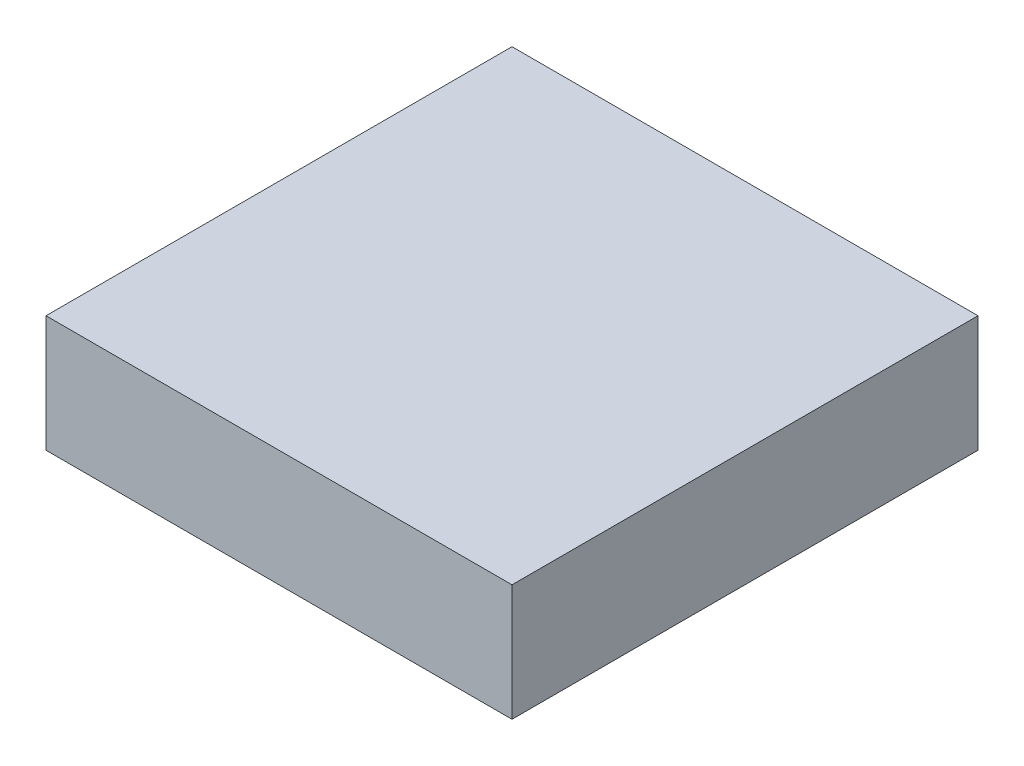
ISO-10303-21;
HEADER;
FILE_DESCRIPTION(('STEP AP214'),'2;1');
FILE_NAME('part.step','',(''),(''),'','','');
FILE_SCHEMA(('AUTOMOTIVE_DESIGN { 1 0 10303 214 1 1 1 1 }'));
ENDSEC;
DATA;
#1=APPLICATION_CONTEXT('core data for automotive mechanical design processes');
#2=APPLICATION_PROTOCOL_DEFINITION('international standard','automotive_design',2000,#1);
#3=PRODUCT_CONTEXT('',#1,'mechanical');
#4=PRODUCT('Part','Part','',(#3));
#5=PRODUCT_RELATED_PRODUCT_CATEGORY('part','',(#4));
#6=PRODUCT_DEFINITION_FORMATION('','',#4);
#7=PRODUCT_DEFINITION_CONTEXT('part definition',#1,'design');
#8=PRODUCT_DEFINITION('design','',#6,#7);
#9=PRODUCT_DEFINITION_SHAPE('','',#8);
#10=(LENGTH_UNIT() NAMED_UNIT(*) SI_UNIT(.MILLI.,.METRE.));
#11=(NAMED_UNIT(*) PLANE_ANGLE_UNIT() SI_UNIT($,.RADIAN.));
#12=(NAMED_UNIT(*) SI_UNIT($,.STERADIAN.) SOLID_ANGLE_UNIT());
#13=UNCERTAINTY_MEASURE_WITH_UNIT(LENGTH_MEASURE(1.E-05),#10,'distance_accuracy_value','');
#14=(GEOMETRIC_REPRESENTATION_CONTEXT(3) GLOBAL_UNCERTAINTY_ASSIGNED_CONTEXT((#13)) GLOBAL_UNIT_ASSIGNED_CONTEXT((#10,
#11,#12)) REPRESENTATION_CONTEXT('',''));
#15=CARTESIAN_POINT('',(0.,0.,0.));
#16=DIRECTION('',(0.,0.,1.));
#17=DIRECTION('',(1.,0.,0.));
#18=AXIS2_PLACEMENT_3D('',#15,#16,#17);
#19=CARTESIAN_POINT('',(-10.,5.,10.));
#20=DIRECTION('',(1.,0.,0.));
#21=DIRECTION('',(0.,0.,-1.));
#22=AXIS2_PLACEMENT_3D('',#19,#20,#21);
#23=PLANE('',#22);
#24=DIRECTION('',(0.,0.,1.));
#25=VECTOR('',#24,1.);
#26=CARTESIAN_POINT('',(-10.,0.,10.));
#27=LINE('',#26,#25);
#28=CARTESIAN_POINT('',(-10.,0.,-10.));
#29=VERTEX_POINT('',#28);
#30=CARTESIAN_POINT('',(-10.,0.,10.));
#31=VERTEX_POINT('',#30);
#32=EDGE_CURVE('E102',#29,#31,#27,.T.);
#33=ORIENTED_EDGE('',*,*,#32,.T.);
#34=DIRECTION('',(0.,-1.,0.));
#35=VECTOR('',#34,1.);
#36=CARTESIAN_POINT('',(-10.,5.,10.));
#37=LINE('',#36,#35);
#38=CARTESIAN_POINT('',(-10.,5.,10.));
#39=VERTEX_POINT('',#38);
#40=EDGE_CURVE('E11',#39,#31,#37,.T.);
#41=ORIENTED_EDGE('',*,*,#40,.F.);
#42=DIRECTION('',(0.,0.,1.));
#43=VECTOR('',#42,1.);
#44=CARTESIAN_POINT('',(-10.,5.,10.));
#45=LINE('',#44,#43);
#46=CARTESIAN_POINT('',(-10.,5.,-10.));
#47=VERTEX_POINT('',#46);
#48=EDGE_CURVE('E90',#47,#39,#45,.T.);
#49=ORIENTED_EDGE('',*,*,#48,.F.);
#50=DIRECTION('',(0.,-1.,0.));
#51=VECTOR('',#50,1.);
#52=CARTESIAN_POINT('',(-10.,5.,-10.));
#53=LINE('',#52,#51);
#54=EDGE_CURVE('E98',#47,#29,#53,.T.);
#55=ORIENTED_EDGE('',*,*,#54,.T.);
#56=EDGE_LOOP('',(#33,#41,#49,#55));
#57=FACE_BOUND('',#56,.T.);
#58=ADVANCED_FACE('F39',(#57),#23,.F.);
#59=CARTESIAN_POINT('',(-10.,5.,10.));
#60=DIRECTION('',(0.,0.,-1.));
#61=DIRECTION('',(-1.,0.,0.));
#62=AXIS2_PLACEMENT_3D('',#59,#60,#61);
#63=PLANE('',#62);
#64=DIRECTION('',(1.,0.,0.));
#65=VECTOR('',#64,1.);
#66=CARTESIAN_POINT('',(-10.,0.,10.));
#67=LINE('',#66,#65);
#68=CARTESIAN_POINT('',(10.,0.,10.));
#69=VERTEX_POINT('',#68);
#70=EDGE_CURVE('E94',#31,#69,#67,.T.);
#71=ORIENTED_EDGE('',*,*,#70,.T.);
#72=DIRECTION('',(0.,-1.,0.));
#73=VECTOR('',#72,1.);
#74=CARTESIAN_POINT('',(10.,5.,10.));
#75=LINE('',#74,#73);
#76=CARTESIAN_POINT('',(10.,5.,10.));
#77=VERTEX_POINT('',#76);
#78=EDGE_CURVE('E47',#77,#69,#75,.T.);
#79=ORIENTED_EDGE('',*,*,#78,.F.);
#80=DIRECTION('',(1.,0.,0.));
#81=VECTOR('',#80,1.);
#82=CARTESIAN_POINT('',(-10.,5.,10.));
#83=LINE('',#82,#81);
#84=EDGE_CURVE('E85',#39,#77,#83,.T.);
#85=ORIENTED_EDGE('',*,*,#84,.F.);
#86=ORIENTED_EDGE('',*,*,#40,.T.);
#87=EDGE_LOOP('',(#71,#79,#85,#86));
#88=FACE_BOUND('',#87,.T.);
#89=ADVANCED_FACE('F93',(#88),#63,.F.);
#90=CARTESIAN_POINT('',(10.,5.,10.));
#91=DIRECTION('',(-1.,0.,0.));
#92=DIRECTION('',(0.,0.,1.));
#93=AXIS2_PLACEMENT_3D('',#90,#91,#92);
#94=PLANE('',#93);
#95=DIRECTION('',(0.,0.,-1.));
#96=VECTOR('',#95,1.);
#97=CARTESIAN_POINT('',(10.,0.,10.));
#98=LINE('',#97,#96);
#99=CARTESIAN_POINT('',(10.,0.,-10.));
#100=VERTEX_POINT('',#99);
#101=EDGE_CURVE('E72',#69,#100,#98,.T.);
#102=ORIENTED_EDGE('',*,*,#101,.T.);
#103=DIRECTION('',(0.,-1.,0.));
#104=VECTOR('',#103,1.);
#105=CARTESIAN_POINT('',(10.,5.,-10.));
#106=LINE('',#105,#104);
#107=CARTESIAN_POINT('',(10.,5.,-10.));
#108=VERTEX_POINT('',#107);
#109=EDGE_CURVE('E95',#108,#100,#106,.T.);
#110=ORIENTED_EDGE('',*,*,#109,.F.);
#111=DIRECTION('',(0.,0.,-1.));
#112=VECTOR('',#111,1.);
#113=CARTESIAN_POINT('',(10.,5.,10.));
#114=LINE('',#113,#112);
#115=EDGE_CURVE('E88',#77,#108,#114,.T.);
#116=ORIENTED_EDGE('',*,*,#115,.F.);
#117=ORIENTED_EDGE('',*,*,#78,.T.);
#118=EDGE_LOOP('',(#102,#110,#116,#117));
#119=FACE_BOUND('',#118,.T.);
#120=ADVANCED_FACE('F96',(#119),#94,.F.);
#121=CARTESIAN_POINT('',(-10.,5.,-10.));
#122=DIRECTION('',(0.,0.,1.));
#123=DIRECTION('',(1.,0.,0.));
#124=AXIS2_PLACEMENT_3D('',#121,#122,#123);
#125=PLANE('',#124);
#126=DIRECTION('',(-1.,0.,0.));
#127=VECTOR('',#126,1.);
#128=CARTESIAN_POINT('',(-10.,0.,-10.));
#129=LINE('',#128,#127);
#130=EDGE_CURVE('E78',#100,#29,#129,.T.);
#131=ORIENTED_EDGE('',*,*,#130,.T.);
#132=ORIENTED_EDGE('',*,*,#54,.F.);
#133=DIRECTION('',(-1.,0.,0.));
#134=VECTOR('',#133,1.);
#135=CARTESIAN_POINT('',(-10.,5.,-10.));
#136=LINE('',#135,#134);
#137=EDGE_CURVE('E55',#108,#47,#136,.T.);
#138=ORIENTED_EDGE('',*,*,#137,.F.);
#139=ORIENTED_EDGE('',*,*,#109,.T.);
#140=EDGE_LOOP('',(#131,#132,#138,#139));
#141=FACE_BOUND('',#140,.T.);
#142=ADVANCED_FACE('F109',(#141),#125,.F.);
#143=CARTESIAN_POINT('',(0.,5.,0.));
#144=DIRECTION('',(0.,-1.,0.));
#145=DIRECTION('',(0.,0.,-1.));
#146=AXIS2_PLACEMENT_3D('',#143,#144,#145);
#147=PLANE('',#146);
#148=ORIENTED_EDGE('',*,*,#48,.T.);
#149=ORIENTED_EDGE('',*,*,#84,.T.);
#150=ORIENTED_EDGE('',*,*,#115,.T.);
#151=ORIENTED_EDGE('',*,*,#137,.T.);
#152=EDGE_LOOP('',(#148,#149,#150,#151));
#153=FACE_BOUND('',#152,.T.);
#154=ADVANCED_FACE('F86',(#153),#147,.F.);
#155=CARTESIAN_POINT('',(0.,0.,0.));
#156=DIRECTION('',(0.,-1.,0.));
#157=DIRECTION('',(0.,0.,-1.));
#158=AXIS2_PLACEMENT_3D('',#155,#156,#157);
#159=PLANE('',#158);
#160=ORIENTED_EDGE('',*,*,#32,.F.);
#161=ORIENTED_EDGE('',*,*,#130,.F.);
#162=ORIENTED_EDGE('',*,*,#101,.F.);
#163=ORIENTED_EDGE('',*,*,#70,.F.);
#164=EDGE_LOOP('',(#160,#161,#162,#163));
#165=FACE_BOUND('',#164,.T.);
#166=ADVANCED_FACE('F112',(#165),#159,.T.);
#167=CLOSED_SHELL('',(#58,#89,#120,#142,#154,#166));
#168=MANIFOLD_SOLID_BREP('B2',#167);
#169=ADVANCED_BREP_SHAPE_REPRESENTATION('',(#18,#168),#14);
#170=SHAPE_DEFINITION_REPRESENTATION(#9,#169);
ENDSEC;
END-ISO-10303-21;
